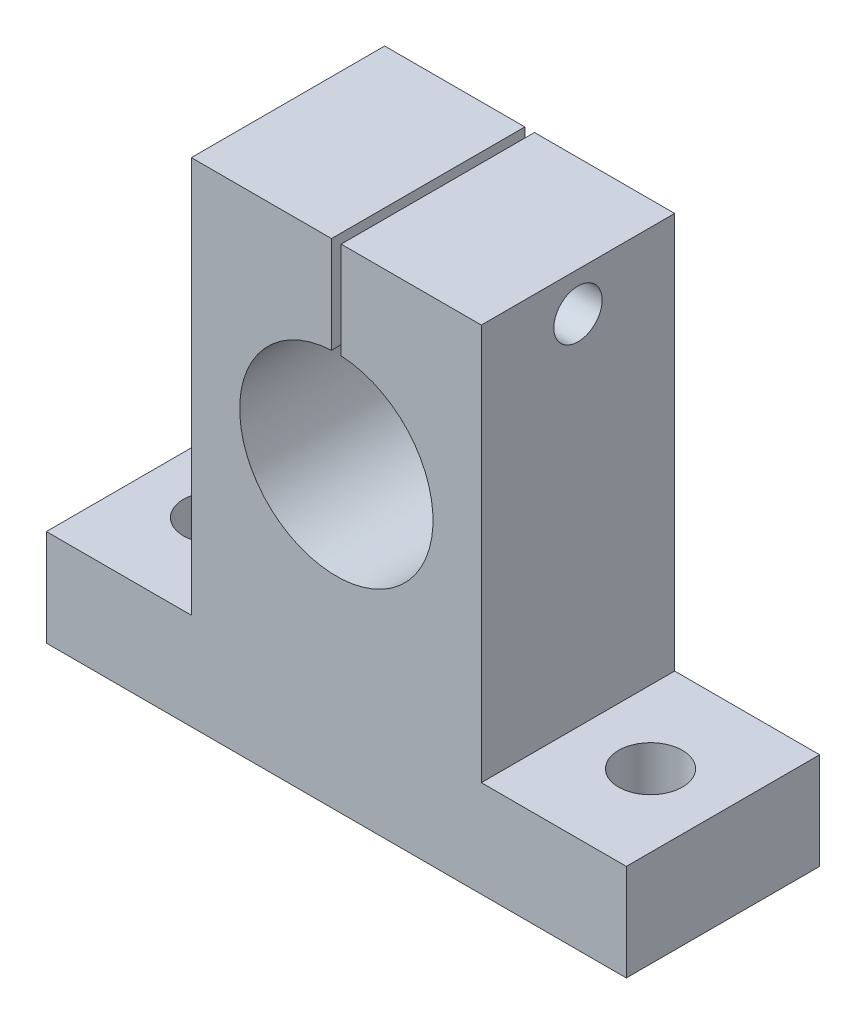
ISO-10303-21;
HEADER;
FILE_DESCRIPTION(('STEP AP214'),'2;1');
FILE_NAME('part.step','',(''),(''),'','','');
FILE_SCHEMA(('AUTOMOTIVE_DESIGN { 1 0 10303 214 1 1 1 1 }'));
ENDSEC;
DATA;
#1=APPLICATION_CONTEXT('core data for automotive mechanical design processes');
#2=APPLICATION_PROTOCOL_DEFINITION('international standard','automotive_design',2000,#1);
#3=PRODUCT_CONTEXT('',#1,'mechanical');
#4=PRODUCT('Part','Part','',(#3));
#5=PRODUCT_RELATED_PRODUCT_CATEGORY('part','',(#4));
#6=PRODUCT_DEFINITION_FORMATION('','',#4);
#7=PRODUCT_DEFINITION_CONTEXT('part definition',#1,'design');
#8=PRODUCT_DEFINITION('design','',#6,#7);
#9=PRODUCT_DEFINITION_SHAPE('','',#8);
#10=(LENGTH_UNIT() NAMED_UNIT(*) SI_UNIT(.MILLI.,.METRE.));
#11=(NAMED_UNIT(*) PLANE_ANGLE_UNIT() SI_UNIT($,.RADIAN.));
#12=(NAMED_UNIT(*) SI_UNIT($,.STERADIAN.) SOLID_ANGLE_UNIT());
#13=UNCERTAINTY_MEASURE_WITH_UNIT(LENGTH_MEASURE(1.E-05),#10,'distance_accuracy_value','');
#14=(GEOMETRIC_REPRESENTATION_CONTEXT(3) GLOBAL_UNCERTAINTY_ASSIGNED_CONTEXT((#13)) GLOBAL_UNIT_ASSIGNED_CONTEXT((#10,
#11,#12)) REPRESENTATION_CONTEXT('',''));
#15=CARTESIAN_POINT('',(0.,0.,0.));
#16=DIRECTION('',(0.,0.,1.));
#17=DIRECTION('',(1.,0.,0.));
#18=AXIS2_PLACEMENT_3D('',#15,#16,#17);
#19=CARTESIAN_POINT('',(0.,0.,20.));
#20=DIRECTION('',(0.,0.,-1.));
#21=DIRECTION('',(-1.,0.,0.));
#22=AXIS2_PLACEMENT_3D('',#19,#20,#21);
#23=PLANE('',#22);
#24=DIRECTION('',(0.,-1.,0.));
#25=VECTOR('',#24,1.);
#26=CARTESIAN_POINT('',(0.499999999999999,51.,20.));
#27=LINE('',#26,#25);
#28=CARTESIAN_POINT('',(0.499999999999999,51.,20.));
#29=VERTEX_POINT('',#28);
#30=CARTESIAN_POINT('',(0.5,40.9874921777191,20.));
#31=VERTEX_POINT('',#30);
#32=EDGE_CURVE('E121',#29,#31,#27,.T.);
#33=ORIENTED_EDGE('',*,*,#32,.T.);
#34=CARTESIAN_POINT('',(0.,31.,20.));
#35=DIRECTION('',(0.,0.,1.));
#36=DIRECTION('',(1.,0.,0.));
#37=AXIS2_PLACEMENT_3D('',#34,#35,#36);
#38=CIRCLE('',#37,10.);
#39=CARTESIAN_POINT('',(-0.5,40.9874921777191,20.));
#40=VERTEX_POINT('',#39);
#41=EDGE_CURVE('E159',#40,#31,#38,.T.);
#42=ORIENTED_EDGE('',*,*,#41,.F.);
#43=DIRECTION('',(0.,-1.,0.));
#44=VECTOR('',#43,1.);
#45=CARTESIAN_POINT('',(-0.5,51.,20.));
#46=LINE('',#45,#44);
#47=CARTESIAN_POINT('',(-0.5,51.,20.));
#48=VERTEX_POINT('',#47);
#49=EDGE_CURVE('E57',#48,#40,#46,.T.);
#50=ORIENTED_EDGE('',*,*,#49,.F.);
#51=DIRECTION('',(-1.,0.,0.));
#52=VECTOR('',#51,1.);
#53=CARTESIAN_POINT('',(-15.,51.,20.));
#54=LINE('',#53,#52);
#55=CARTESIAN_POINT('',(-15.,51.,20.));
#56=VERTEX_POINT('',#55);
#57=EDGE_CURVE('E146',#48,#56,#54,.T.);
#58=ORIENTED_EDGE('',*,*,#57,.T.);
#59=DIRECTION('',(0.,-1.,0.));
#60=VECTOR('',#59,1.);
#61=CARTESIAN_POINT('',(-15.,10.,20.));
#62=LINE('',#61,#60);
#63=CARTESIAN_POINT('',(-15.,10.,20.));
#64=VERTEX_POINT('',#63);
#65=EDGE_CURVE('E145',#56,#64,#62,.T.);
#66=ORIENTED_EDGE('',*,*,#65,.T.);
#67=DIRECTION('',(-1.,0.,0.));
#68=VECTOR('',#67,1.);
#69=CARTESIAN_POINT('',(-30.,10.,20.));
#70=LINE('',#69,#68);
#71=CARTESIAN_POINT('',(-30.,10.,20.));
#72=VERTEX_POINT('',#71);
#73=EDGE_CURVE('E148',#64,#72,#70,.T.);
#74=ORIENTED_EDGE('',*,*,#73,.T.);
#75=DIRECTION('',(0.,-1.,0.));
#76=VECTOR('',#75,1.);
#77=CARTESIAN_POINT('',(-30.,0.,20.));
#78=LINE('',#77,#76);
#79=CARTESIAN_POINT('',(-30.,0.,20.));
#80=VERTEX_POINT('',#79);
#81=EDGE_CURVE('E173',#72,#80,#78,.T.);
#82=ORIENTED_EDGE('',*,*,#81,.T.);
#83=DIRECTION('',(1.,0.,0.));
#84=VECTOR('',#83,1.);
#85=CARTESIAN_POINT('',(-30.,0.,20.));
#86=LINE('',#85,#84);
#87=CARTESIAN_POINT('',(30.,0.,20.));
#88=VERTEX_POINT('',#87);
#89=EDGE_CURVE('E215',#80,#88,#86,.T.);
#90=ORIENTED_EDGE('',*,*,#89,.T.);
#91=DIRECTION('',(0.,1.,0.));
#92=VECTOR('',#91,1.);
#93=CARTESIAN_POINT('',(30.,0.,20.));
#94=LINE('',#93,#92);
#95=CARTESIAN_POINT('',(30.,10.,20.));
#96=VERTEX_POINT('',#95);
#97=EDGE_CURVE('E217',#88,#96,#94,.T.);
#98=ORIENTED_EDGE('',*,*,#97,.T.);
#99=DIRECTION('',(-1.,0.,0.));
#100=VECTOR('',#99,1.);
#101=CARTESIAN_POINT('',(15.,10.,20.));
#102=LINE('',#101,#100);
#103=CARTESIAN_POINT('',(15.,10.,20.));
#104=VERTEX_POINT('',#103);
#105=EDGE_CURVE('E218',#96,#104,#102,.T.);
#106=ORIENTED_EDGE('',*,*,#105,.T.);
#107=DIRECTION('',(0.,1.,0.));
#108=VECTOR('',#107,1.);
#109=CARTESIAN_POINT('',(15.,10.,20.));
#110=LINE('',#109,#108);
#111=CARTESIAN_POINT('',(15.,51.,20.));
#112=VERTEX_POINT('',#111);
#113=EDGE_CURVE('E143',#104,#112,#110,.T.);
#114=ORIENTED_EDGE('',*,*,#113,.T.);
#115=EDGE_CURVE('E136',#112,#29,#54,.T.);
#116=ORIENTED_EDGE('',*,*,#115,.T.);
#117=EDGE_LOOP('',(#33,#42,#50,#58,#66,#74,#82,#90,#98,#106,#114,#116));
#118=FACE_BOUND('',#117,.T.);
#119=ADVANCED_FACE('F34',(#118),#23,.F.);
#120=CARTESIAN_POINT('',(0.,0.,0.));
#121=DIRECTION('',(0.,0.,-1.));
#122=DIRECTION('',(-1.,0.,0.));
#123=AXIS2_PLACEMENT_3D('',#120,#121,#122);
#124=PLANE('',#123);
#125=CARTESIAN_POINT('',(0.,31.,0.));
#126=DIRECTION('',(0.,0.,1.));
#127=DIRECTION('',(1.,0.,0.));
#128=AXIS2_PLACEMENT_3D('',#125,#126,#127);
#129=CIRCLE('',#128,10.);
#130=CARTESIAN_POINT('',(-0.5,40.9874921777191,0.));
#131=VERTEX_POINT('',#130);
#132=CARTESIAN_POINT('',(0.5,40.9874921777191,0.));
#133=VERTEX_POINT('',#132);
#134=EDGE_CURVE('E205',#131,#133,#129,.T.);
#135=ORIENTED_EDGE('',*,*,#134,.T.);
#136=DIRECTION('',(0.,1.,0.));
#137=VECTOR('',#136,1.);
#138=CARTESIAN_POINT('',(0.500000000000007,0.,0.));
#139=LINE('',#138,#137);
#140=CARTESIAN_POINT('',(0.499999999999999,51.,0.));
#141=VERTEX_POINT('',#140);
#142=EDGE_CURVE('E50',#133,#141,#139,.T.);
#143=ORIENTED_EDGE('',*,*,#142,.T.);
#144=DIRECTION('',(-1.,0.,0.));
#145=VECTOR('',#144,1.);
#146=CARTESIAN_POINT('',(-15.,51.,0.));
#147=LINE('',#146,#145);
#148=CARTESIAN_POINT('',(15.,51.,0.));
#149=VERTEX_POINT('',#148);
#150=EDGE_CURVE('E138',#149,#141,#147,.T.);
#151=ORIENTED_EDGE('',*,*,#150,.F.);
#152=DIRECTION('',(0.,1.,0.));
#153=VECTOR('',#152,1.);
#154=CARTESIAN_POINT('',(15.,10.,0.));
#155=LINE('',#154,#153);
#156=CARTESIAN_POINT('',(15.,10.,0.));
#157=VERTEX_POINT('',#156);
#158=EDGE_CURVE('E165',#157,#149,#155,.T.);
#159=ORIENTED_EDGE('',*,*,#158,.F.);
#160=DIRECTION('',(-1.,0.,0.));
#161=VECTOR('',#160,1.);
#162=CARTESIAN_POINT('',(15.,10.,0.));
#163=LINE('',#162,#161);
#164=CARTESIAN_POINT('',(30.,10.,0.));
#165=VERTEX_POINT('',#164);
#166=EDGE_CURVE('E163',#165,#157,#163,.T.);
#167=ORIENTED_EDGE('',*,*,#166,.F.);
#168=DIRECTION('',(0.,1.,0.));
#169=VECTOR('',#168,1.);
#170=CARTESIAN_POINT('',(30.,0.,0.));
#171=LINE('',#170,#169);
#172=CARTESIAN_POINT('',(30.,0.,0.));
#173=VERTEX_POINT('',#172);
#174=EDGE_CURVE('E161',#173,#165,#171,.T.);
#175=ORIENTED_EDGE('',*,*,#174,.F.);
#176=DIRECTION('',(1.,0.,0.));
#177=VECTOR('',#176,1.);
#178=CARTESIAN_POINT('',(-30.,0.,0.));
#179=LINE('',#178,#177);
#180=CARTESIAN_POINT('',(-30.,0.,0.));
#181=VERTEX_POINT('',#180);
#182=EDGE_CURVE('E158',#181,#173,#179,.T.);
#183=ORIENTED_EDGE('',*,*,#182,.F.);
#184=DIRECTION('',(0.,-1.,0.));
#185=VECTOR('',#184,1.);
#186=CARTESIAN_POINT('',(-30.,0.,0.));
#187=LINE('',#186,#185);
#188=CARTESIAN_POINT('',(-30.,10.,0.));
#189=VERTEX_POINT('',#188);
#190=EDGE_CURVE('E155',#189,#181,#187,.T.);
#191=ORIENTED_EDGE('',*,*,#190,.F.);
#192=DIRECTION('',(-1.,0.,0.));
#193=VECTOR('',#192,1.);
#194=CARTESIAN_POINT('',(-30.,10.,0.));
#195=LINE('',#194,#193);
#196=CARTESIAN_POINT('',(-15.,10.,0.));
#197=VERTEX_POINT('',#196);
#198=EDGE_CURVE('E171',#197,#189,#195,.T.);
#199=ORIENTED_EDGE('',*,*,#198,.F.);
#200=DIRECTION('',(0.,-1.,0.));
#201=VECTOR('',#200,1.);
#202=CARTESIAN_POINT('',(-15.,10.,0.));
#203=LINE('',#202,#201);
#204=CARTESIAN_POINT('',(-15.,51.,0.));
#205=VERTEX_POINT('',#204);
#206=EDGE_CURVE('E169',#205,#197,#203,.T.);
#207=ORIENTED_EDGE('',*,*,#206,.F.);
#208=CARTESIAN_POINT('',(-0.5,51.,0.));
#209=VERTEX_POINT('',#208);
#210=EDGE_CURVE('E167',#209,#205,#147,.T.);
#211=ORIENTED_EDGE('',*,*,#210,.F.);
#212=DIRECTION('',(0.,1.,0.));
#213=VECTOR('',#212,1.);
#214=CARTESIAN_POINT('',(-0.5,0.,0.));
#215=LINE('',#214,#213);
#216=EDGE_CURVE('E139',#131,#209,#215,.T.);
#217=ORIENTED_EDGE('',*,*,#216,.F.);
#218=EDGE_LOOP('',(#135,#143,#151,#159,#167,#175,#183,#191,#199,#207,#211,#217));
#219=FACE_BOUND('',#218,.T.);
#220=ADVANCED_FACE('F204',(#219),#124,.T.);
#221=CARTESIAN_POINT('',(-15.,51.,20.));
#222=DIRECTION('',(0.,-1.,0.));
#223=DIRECTION('',(1.,0.,0.));
#224=AXIS2_PLACEMENT_3D('',#221,#222,#223);
#225=PLANE('',#224);
#226=DIRECTION('',(0.,0.,1.));
#227=VECTOR('',#226,1.);
#228=CARTESIAN_POINT('',(0.499999999999999,51.,-39.));
#229=LINE('',#228,#227);
#230=EDGE_CURVE('E124',#141,#29,#229,.T.);
#231=ORIENTED_EDGE('',*,*,#230,.T.);
#232=ORIENTED_EDGE('',*,*,#115,.F.);
#233=DIRECTION('',(0.,0.,-1.));
#234=VECTOR('',#233,1.);
#235=CARTESIAN_POINT('',(15.,51.,20.));
#236=LINE('',#235,#234);
#237=EDGE_CURVE('E182',#112,#149,#236,.T.);
#238=ORIENTED_EDGE('',*,*,#237,.T.);
#239=ORIENTED_EDGE('',*,*,#150,.T.);
#240=EDGE_LOOP('',(#231,#232,#238,#239));
#241=FACE_BOUND('',#240,.T.);
#242=ADVANCED_FACE('F134',(#241),#225,.F.);
#243=CARTESIAN_POINT('',(0.,31.,20.));
#244=DIRECTION('',(0.,0.,-1.));
#245=DIRECTION('',(-1.,0.,0.));
#246=AXIS2_PLACEMENT_3D('',#243,#244,#245);
#247=CYLINDRICAL_SURFACE('',#246,10.);
#248=ORIENTED_EDGE('',*,*,#41,.T.);
#249=DIRECTION('',(0.,0.,-1.));
#250=VECTOR('',#249,1.);
#251=CARTESIAN_POINT('',(0.5,40.9874921777191,20.));
#252=LINE('',#251,#250);
#253=EDGE_CURVE('E11',#31,#133,#252,.T.);
#254=ORIENTED_EDGE('',*,*,#253,.T.);
#255=ORIENTED_EDGE('',*,*,#134,.F.);
#256=DIRECTION('',(0.,0.,-1.));
#257=VECTOR('',#256,1.);
#258=CARTESIAN_POINT('',(-0.5,40.9874921777191,20.));
#259=LINE('',#258,#257);
#260=EDGE_CURVE('E43',#40,#131,#259,.T.);
#261=ORIENTED_EDGE('',*,*,#260,.F.);
#262=EDGE_LOOP('',(#248,#254,#255,#261));
#263=FACE_BOUND('',#262,.T.);
#264=ADVANCED_FACE('F208',(#263),#247,.F.);
#265=CARTESIAN_POINT('',(-30.,0.,20.));
#266=DIRECTION('',(1.,0.,0.));
#267=DIRECTION('',(0.,1.,0.));
#268=AXIS2_PLACEMENT_3D('',#265,#266,#267);
#269=PLANE('',#268);
#270=ORIENTED_EDGE('',*,*,#190,.T.);
#271=DIRECTION('',(0.,0.,-1.));
#272=VECTOR('',#271,1.);
#273=CARTESIAN_POINT('',(-30.,0.,20.));
#274=LINE('',#273,#272);
#275=EDGE_CURVE('E193',#80,#181,#274,.T.);
#276=ORIENTED_EDGE('',*,*,#275,.F.);
#277=ORIENTED_EDGE('',*,*,#81,.F.);
#278=DIRECTION('',(0.,0.,-1.));
#279=VECTOR('',#278,1.);
#280=CARTESIAN_POINT('',(-30.,10.,20.));
#281=LINE('',#280,#279);
#282=EDGE_CURVE('E154',#72,#189,#281,.T.);
#283=ORIENTED_EDGE('',*,*,#282,.T.);
#284=EDGE_LOOP('',(#270,#276,#277,#283));
#285=FACE_BOUND('',#284,.T.);
#286=ADVANCED_FACE('F36',(#285),#269,.F.);
#287=CARTESIAN_POINT('',(-30.,0.,20.));
#288=DIRECTION('',(0.,1.,0.));
#289=DIRECTION('',(-1.,0.,0.));
#290=AXIS2_PLACEMENT_3D('',#287,#288,#289);
#291=PLANE('',#290);
#292=CARTESIAN_POINT('',(22.5,0.,10.));
#293=DIRECTION('',(0.,1.,0.));
#294=DIRECTION('',(-1.,0.,0.));
#295=AXIS2_PLACEMENT_3D('',#292,#293,#294);
#296=CIRCLE('',#295,3.3);
#297=CARTESIAN_POINT('',(19.2,0.,10.));
#298=VERTEX_POINT('',#297);
#299=EDGE_CURVE('E263',#298,#298,#296,.T.);
#300=ORIENTED_EDGE('',*,*,#299,.T.);
#301=EDGE_LOOP('',(#300));
#302=FACE_BOUND('',#301,.T.);
#303=CARTESIAN_POINT('',(-22.5,0.,10.));
#304=DIRECTION('',(0.,1.,0.));
#305=DIRECTION('',(-1.,0.,0.));
#306=AXIS2_PLACEMENT_3D('',#303,#304,#305);
#307=CIRCLE('',#306,3.3);
#308=CARTESIAN_POINT('',(-25.8,0.,10.));
#309=VERTEX_POINT('',#308);
#310=EDGE_CURVE('E266',#309,#309,#307,.T.);
#311=ORIENTED_EDGE('',*,*,#310,.T.);
#312=EDGE_LOOP('',(#311));
#313=FACE_BOUND('',#312,.T.);
#314=ORIENTED_EDGE('',*,*,#182,.T.);
#315=DIRECTION('',(0.,0.,-1.));
#316=VECTOR('',#315,1.);
#317=CARTESIAN_POINT('',(30.,0.,20.));
#318=LINE('',#317,#316);
#319=EDGE_CURVE('E190',#88,#173,#318,.T.);
#320=ORIENTED_EDGE('',*,*,#319,.F.);
#321=ORIENTED_EDGE('',*,*,#89,.F.);
#322=ORIENTED_EDGE('',*,*,#275,.T.);
#323=EDGE_LOOP('',(#314,#320,#321,#322));
#324=FACE_BOUND('',#323,.T.);
#325=ADVANCED_FACE('F235',(#302,#313,#324),#291,.F.);
#326=CARTESIAN_POINT('',(30.,0.,20.));
#327=DIRECTION('',(-1.,0.,0.));
#328=DIRECTION('',(0.,-1.,0.));
#329=AXIS2_PLACEMENT_3D('',#326,#327,#328);
#330=PLANE('',#329);
#331=ORIENTED_EDGE('',*,*,#174,.T.);
#332=DIRECTION('',(0.,0.,-1.));
#333=VECTOR('',#332,1.);
#334=CARTESIAN_POINT('',(30.,10.,20.));
#335=LINE('',#334,#333);
#336=EDGE_CURVE('E187',#96,#165,#335,.T.);
#337=ORIENTED_EDGE('',*,*,#336,.F.);
#338=ORIENTED_EDGE('',*,*,#97,.F.);
#339=ORIENTED_EDGE('',*,*,#319,.T.);
#340=EDGE_LOOP('',(#331,#337,#338,#339));
#341=FACE_BOUND('',#340,.T.);
#342=ADVANCED_FACE('F232',(#341),#330,.F.);
#343=CARTESIAN_POINT('',(15.,10.,20.));
#344=DIRECTION('',(0.,-1.,0.));
#345=DIRECTION('',(1.,0.,0.));
#346=AXIS2_PLACEMENT_3D('',#343,#344,#345);
#347=PLANE('',#346);
#348=CARTESIAN_POINT('',(22.5,10.,10.));
#349=DIRECTION('',(0.,1.,0.));
#350=DIRECTION('',(-1.,0.,0.));
#351=AXIS2_PLACEMENT_3D('',#348,#349,#350);
#352=CIRCLE('',#351,3.3);
#353=CARTESIAN_POINT('',(19.2,10.,10.));
#354=VERTEX_POINT('',#353);
#355=EDGE_CURVE('E269',#354,#354,#352,.T.);
#356=ORIENTED_EDGE('',*,*,#355,.F.);
#357=EDGE_LOOP('',(#356));
#358=FACE_BOUND('',#357,.T.);
#359=ORIENTED_EDGE('',*,*,#166,.T.);
#360=DIRECTION('',(0.,0.,-1.));
#361=VECTOR('',#360,1.);
#362=CARTESIAN_POINT('',(15.,10.,20.));
#363=LINE('',#362,#361);
#364=EDGE_CURVE('E184',#104,#157,#363,.T.);
#365=ORIENTED_EDGE('',*,*,#364,.F.);
#366=ORIENTED_EDGE('',*,*,#105,.F.);
#367=ORIENTED_EDGE('',*,*,#336,.T.);
#368=EDGE_LOOP('',(#359,#365,#366,#367));
#369=FACE_BOUND('',#368,.T.);
#370=ADVANCED_FACE('F224',(#358,#369),#347,.F.);
#371=CARTESIAN_POINT('',(15.,10.,20.));
#372=DIRECTION('',(-1.,0.,0.));
#373=DIRECTION('',(0.,0.,1.));
#374=AXIS2_PLACEMENT_3D('',#371,#372,#373);
#375=PLANE('',#374);
#376=CARTESIAN_POINT('',(15.,47.,10.));
#377=DIRECTION('',(1.,0.,0.));
#378=DIRECTION('',(0.,0.,-1.));
#379=AXIS2_PLACEMENT_3D('',#376,#377,#378);
#380=CIRCLE('',#379,2.5);
#381=CARTESIAN_POINT('',(15.,47.,7.5));
#382=VERTEX_POINT('',#381);
#383=EDGE_CURVE('E260',#382,#382,#380,.T.);
#384=ORIENTED_EDGE('',*,*,#383,.F.);
#385=EDGE_LOOP('',(#384));
#386=FACE_BOUND('',#385,.T.);
#387=ORIENTED_EDGE('',*,*,#158,.T.);
#388=ORIENTED_EDGE('',*,*,#237,.F.);
#389=ORIENTED_EDGE('',*,*,#113,.F.);
#390=ORIENTED_EDGE('',*,*,#364,.T.);
#391=EDGE_LOOP('',(#387,#388,#389,#390));
#392=FACE_BOUND('',#391,.T.);
#393=ADVANCED_FACE('F228',(#386,#392),#375,.F.);
#394=ORIENTED_EDGE('',*,*,#57,.F.);
#395=DIRECTION('',(0.,0.,1.));
#396=VECTOR('',#395,1.);
#397=CARTESIAN_POINT('',(-0.5,51.,-39.));
#398=LINE('',#397,#396);
#399=EDGE_CURVE('E140',#209,#48,#398,.T.);
#400=ORIENTED_EDGE('',*,*,#399,.F.);
#401=ORIENTED_EDGE('',*,*,#210,.T.);
#402=DIRECTION('',(0.,0.,-1.));
#403=VECTOR('',#402,1.);
#404=CARTESIAN_POINT('',(-15.,51.,20.));
#405=LINE('',#404,#403);
#406=EDGE_CURVE('E179',#56,#205,#405,.T.);
#407=ORIENTED_EDGE('',*,*,#406,.F.);
#408=EDGE_LOOP('',(#394,#400,#401,#407));
#409=FACE_BOUND('',#408,.T.);
#410=ADVANCED_FACE('F251',(#409),#225,.F.);
#411=CARTESIAN_POINT('',(-15.,10.,20.));
#412=DIRECTION('',(1.,0.,0.));
#413=DIRECTION('',(0.,1.,0.));
#414=AXIS2_PLACEMENT_3D('',#411,#412,#413);
#415=PLANE('',#414);
#416=CARTESIAN_POINT('',(-15.,47.,10.));
#417=DIRECTION('',(1.,0.,0.));
#418=DIRECTION('',(0.,1.,0.));
#419=AXIS2_PLACEMENT_3D('',#416,#417,#418);
#420=CIRCLE('',#419,2.5);
#421=CARTESIAN_POINT('',(-15.,49.5,10.));
#422=VERTEX_POINT('',#421);
#423=EDGE_CURVE('E129',#422,#422,#420,.T.);
#424=ORIENTED_EDGE('',*,*,#423,.T.);
#425=EDGE_LOOP('',(#424));
#426=FACE_BOUND('',#425,.T.);
#427=ORIENTED_EDGE('',*,*,#206,.T.);
#428=DIRECTION('',(0.,0.,-1.));
#429=VECTOR('',#428,1.);
#430=CARTESIAN_POINT('',(-15.,10.,20.));
#431=LINE('',#430,#429);
#432=EDGE_CURVE('E176',#64,#197,#431,.T.);
#433=ORIENTED_EDGE('',*,*,#432,.F.);
#434=ORIENTED_EDGE('',*,*,#65,.F.);
#435=ORIENTED_EDGE('',*,*,#406,.T.);
#436=EDGE_LOOP('',(#427,#433,#434,#435));
#437=FACE_BOUND('',#436,.T.);
#438=ADVANCED_FACE('F247',(#426,#437),#415,.F.);
#439=CARTESIAN_POINT('',(-30.,10.,20.));
#440=DIRECTION('',(0.,-1.,0.));
#441=DIRECTION('',(0.,0.,-1.));
#442=AXIS2_PLACEMENT_3D('',#439,#440,#441);
#443=PLANE('',#442);
#444=CARTESIAN_POINT('',(-22.5,9.99999999999999,10.));
#445=DIRECTION('',(0.,1.,0.));
#446=DIRECTION('',(1.,0.,0.));
#447=AXIS2_PLACEMENT_3D('',#444,#445,#446);
#448=CIRCLE('',#447,3.3);
#449=CARTESIAN_POINT('',(-19.2,9.99999999999999,10.));
#450=VERTEX_POINT('',#449);
#451=EDGE_CURVE('E270',#450,#450,#448,.T.);
#452=ORIENTED_EDGE('',*,*,#451,.F.);
#453=EDGE_LOOP('',(#452));
#454=FACE_BOUND('',#453,.T.);
#455=ORIENTED_EDGE('',*,*,#198,.T.);
#456=ORIENTED_EDGE('',*,*,#282,.F.);
#457=ORIENTED_EDGE('',*,*,#73,.F.);
#458=ORIENTED_EDGE('',*,*,#432,.T.);
#459=EDGE_LOOP('',(#455,#456,#457,#458));
#460=FACE_BOUND('',#459,.T.);
#461=ADVANCED_FACE('F242',(#454,#460),#443,.F.);
#462=CARTESIAN_POINT('',(-0.5,51.,-39.));
#463=DIRECTION('',(-1.,0.,0.));
#464=DIRECTION('',(0.,0.,1.));
#465=AXIS2_PLACEMENT_3D('',#462,#463,#464);
#466=PLANE('',#465);
#467=CARTESIAN_POINT('',(-0.5,47.,10.));
#468=DIRECTION('',(-1.,0.,0.));
#469=DIRECTION('',(0.,0.,1.));
#470=AXIS2_PLACEMENT_3D('',#467,#468,#469);
#471=CIRCLE('',#470,2.5);
#472=CARTESIAN_POINT('',(-0.5,47.,12.5));
#473=VERTEX_POINT('',#472);
#474=EDGE_CURVE('E257',#473,#473,#471,.T.);
#475=ORIENTED_EDGE('',*,*,#474,.T.);
#476=EDGE_LOOP('',(#475));
#477=FACE_BOUND('',#476,.T.);
#478=ORIENTED_EDGE('',*,*,#216,.T.);
#479=ORIENTED_EDGE('',*,*,#399,.T.);
#480=ORIENTED_EDGE('',*,*,#49,.T.);
#481=ORIENTED_EDGE('',*,*,#260,.T.);
#482=EDGE_LOOP('',(#478,#479,#480,#481));
#483=FACE_BOUND('',#482,.T.);
#484=ADVANCED_FACE('F197',(#477,#483),#466,.F.);
#485=CARTESIAN_POINT('',(0.499999999999999,51.,-39.));
#486=DIRECTION('',(-1.,0.,0.));
#487=DIRECTION('',(0.,-1.,0.));
#488=AXIS2_PLACEMENT_3D('',#485,#486,#487);
#489=PLANE('',#488);
#490=CARTESIAN_POINT('',(0.5,47.,10.));
#491=DIRECTION('',(-1.,0.,0.));
#492=DIRECTION('',(0.,-1.,0.));
#493=AXIS2_PLACEMENT_3D('',#490,#491,#492);
#494=CIRCLE('',#493,2.5);
#495=CARTESIAN_POINT('',(0.500000000000001,44.5,10.));
#496=VERTEX_POINT('',#495);
#497=EDGE_CURVE('E38',#496,#496,#494,.T.);
#498=ORIENTED_EDGE('',*,*,#497,.F.);
#499=EDGE_LOOP('',(#498));
#500=FACE_BOUND('',#499,.T.);
#501=ORIENTED_EDGE('',*,*,#253,.F.);
#502=ORIENTED_EDGE('',*,*,#32,.F.);
#503=ORIENTED_EDGE('',*,*,#230,.F.);
#504=ORIENTED_EDGE('',*,*,#142,.F.);
#505=EDGE_LOOP('',(#501,#502,#503,#504));
#506=FACE_BOUND('',#505,.T.);
#507=ADVANCED_FACE('F123',(#500,#506),#489,.T.);
#508=CARTESIAN_POINT('',(-16.,47.,10.));
#509=DIRECTION('',(1.,0.,0.));
#510=DIRECTION('',(0.,0.,-1.));
#511=AXIS2_PLACEMENT_3D('',#508,#509,#510);
#512=CYLINDRICAL_SURFACE('',#511,2.5);
#513=ORIENTED_EDGE('',*,*,#497,.T.);
#514=EDGE_LOOP('',(#513));
#515=FACE_BOUND('',#514,.T.);
#516=ORIENTED_EDGE('',*,*,#383,.T.);
#517=EDGE_LOOP('',(#516));
#518=FACE_BOUND('',#517,.T.);
#519=ADVANCED_FACE('F333',(#515,#518),#512,.F.);
#520=ORIENTED_EDGE('',*,*,#474,.F.);
#521=EDGE_LOOP('',(#520));
#522=FACE_BOUND('',#521,.T.);
#523=ORIENTED_EDGE('',*,*,#423,.F.);
#524=EDGE_LOOP('',(#523));
#525=FACE_BOUND('',#524,.T.);
#526=ADVANCED_FACE('F325',(#522,#525),#512,.F.);
#527=CARTESIAN_POINT('',(-22.5,-12.,10.));
#528=DIRECTION('',(0.,1.,0.));
#529=DIRECTION('',(-1.,0.,0.));
#530=AXIS2_PLACEMENT_3D('',#527,#528,#529);
#531=CYLINDRICAL_SURFACE('',#530,3.3);
#532=ORIENTED_EDGE('',*,*,#451,.T.);
#533=EDGE_LOOP('',(#532));
#534=FACE_BOUND('',#533,.T.);
#535=ORIENTED_EDGE('',*,*,#310,.F.);
#536=EDGE_LOOP('',(#535));
#537=FACE_BOUND('',#536,.T.);
#538=ADVANCED_FACE('F323',(#534,#537),#531,.F.);
#539=CARTESIAN_POINT('',(22.5,-12.,10.));
#540=DIRECTION('',(0.,1.,0.));
#541=DIRECTION('',(-1.,0.,0.));
#542=AXIS2_PLACEMENT_3D('',#539,#540,#541);
#543=CYLINDRICAL_SURFACE('',#542,3.3);
#544=ORIENTED_EDGE('',*,*,#355,.T.);
#545=EDGE_LOOP('',(#544));
#546=FACE_BOUND('',#545,.T.);
#547=ORIENTED_EDGE('',*,*,#299,.F.);
#548=EDGE_LOOP('',(#547));
#549=FACE_BOUND('',#548,.T.);
#550=ADVANCED_FACE('F276',(#546,#549),#543,.F.);
#551=CLOSED_SHELL('',(#119,#220,#242,#264,#286,#325,#342,#370,#393,#410,#438,#461,#484,#507,
#519,#526,#538,#550));
#552=MANIFOLD_SOLID_BREP('B2',#551);
#553=ADVANCED_BREP_SHAPE_REPRESENTATION('',(#18,#552),#14);
#554=SHAPE_DEFINITION_REPRESENTATION(#9,#553);
ENDSEC;
END-ISO-10303-21;
